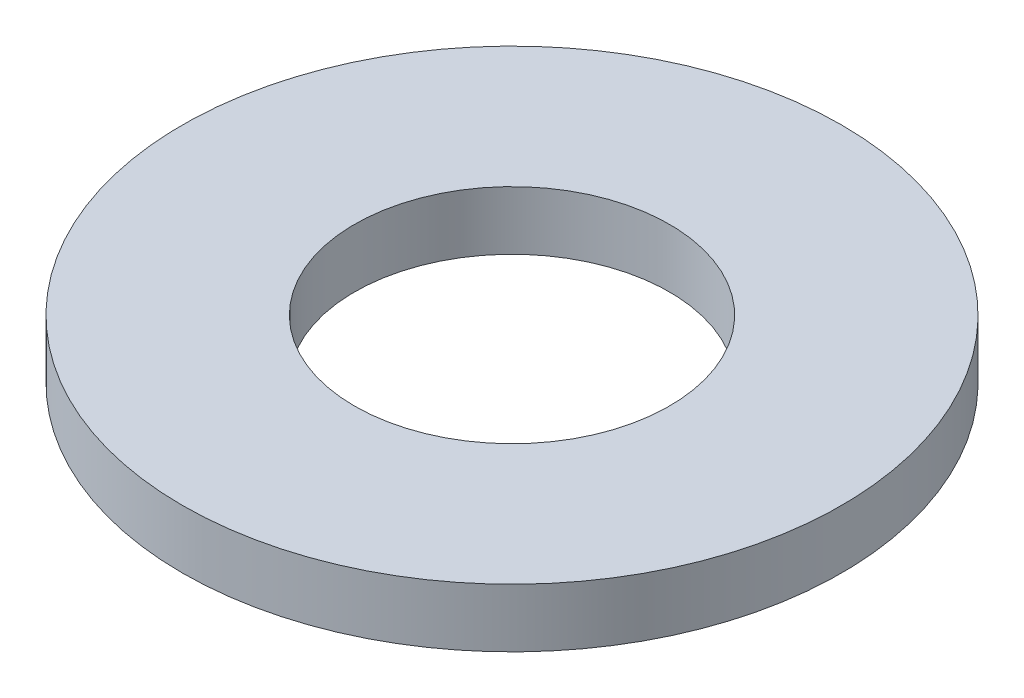
ISO-10303-21;
HEADER;
FILE_DESCRIPTION(('STEP AP214'),'2;1');
FILE_NAME('part.step','',(''),(''),'','','');
FILE_SCHEMA(('AUTOMOTIVE_DESIGN { 1 0 10303 214 1 1 1 1 }'));
ENDSEC;
DATA;
#1=APPLICATION_CONTEXT('core data for automotive mechanical design processes');
#2=APPLICATION_PROTOCOL_DEFINITION('international standard','automotive_design',2000,#1);
#3=PRODUCT_CONTEXT('',#1,'mechanical');
#4=PRODUCT('Part','Part','',(#3));
#5=PRODUCT_RELATED_PRODUCT_CATEGORY('part','',(#4));
#6=PRODUCT_DEFINITION_FORMATION('','',#4);
#7=PRODUCT_DEFINITION_CONTEXT('part definition',#1,'design');
#8=PRODUCT_DEFINITION('design','',#6,#7);
#9=PRODUCT_DEFINITION_SHAPE('','',#8);
#10=(LENGTH_UNIT() NAMED_UNIT(*) SI_UNIT(.MILLI.,.METRE.));
#11=(NAMED_UNIT(*) PLANE_ANGLE_UNIT() SI_UNIT($,.RADIAN.));
#12=(NAMED_UNIT(*) SI_UNIT($,.STERADIAN.) SOLID_ANGLE_UNIT());
#13=UNCERTAINTY_MEASURE_WITH_UNIT(LENGTH_MEASURE(1.E-05),#10,'distance_accuracy_value','');
#14=(GEOMETRIC_REPRESENTATION_CONTEXT(3) GLOBAL_UNCERTAINTY_ASSIGNED_CONTEXT((#13)) GLOBAL_UNIT_ASSIGNED_CONTEXT((#10,
#11,#12)) REPRESENTATION_CONTEXT('',''));
#15=CARTESIAN_POINT('',(0.,0.,0.));
#16=DIRECTION('',(0.,0.,1.));
#17=DIRECTION('',(1.,0.,0.));
#18=AXIS2_PLACEMENT_3D('',#15,#16,#17);
#19=CARTESIAN_POINT('',(0.,0.8,0.));
#20=DIRECTION('',(0.,1.,0.));
#21=DIRECTION('',(0.,0.,1.));
#22=AXIS2_PLACEMENT_3D('',#19,#20,#21);
#23=PLANE('',#22);
#24=CARTESIAN_POINT('',(0.,0.8,0.));
#25=DIRECTION('',(0.,1.,0.));
#26=DIRECTION('',(0.,0.,1.));
#27=AXIS2_PLACEMENT_3D('',#24,#25,#26);
#28=CIRCLE('',#27,4.5);
#29=CARTESIAN_POINT('',(0.,0.8,4.5));
#30=VERTEX_POINT('',#29);
#31=EDGE_CURVE('E10',#30,#30,#28,.T.);
#32=ORIENTED_EDGE('',*,*,#31,.T.);
#33=EDGE_LOOP('',(#32));
#34=FACE_BOUND('',#33,.T.);
#35=CARTESIAN_POINT('',(0.,0.8,0.));
#36=DIRECTION('',(0.,1.,0.));
#37=DIRECTION('',(0.,0.,1.));
#38=AXIS2_PLACEMENT_3D('',#35,#36,#37);
#39=CIRCLE('',#38,2.15);
#40=CARTESIAN_POINT('',(0.,0.8,2.15));
#41=VERTEX_POINT('',#40);
#42=EDGE_CURVE('E39',#41,#41,#39,.T.);
#43=ORIENTED_EDGE('',*,*,#42,.F.);
#44=EDGE_LOOP('',(#43));
#45=FACE_BOUND('',#44,.T.);
#46=ADVANCED_FACE('F28',(#34,#45),#23,.T.);
#47=CARTESIAN_POINT('',(0.,0.,0.));
#48=DIRECTION('',(0.,1.,0.));
#49=DIRECTION('',(0.,0.,1.));
#50=AXIS2_PLACEMENT_3D('',#47,#48,#49);
#51=PLANE('',#50);
#52=CARTESIAN_POINT('',(0.,0.,0.));
#53=DIRECTION('',(0.,1.,0.));
#54=DIRECTION('',(0.,0.,1.));
#55=AXIS2_PLACEMENT_3D('',#52,#53,#54);
#56=CIRCLE('',#55,4.5);
#57=CARTESIAN_POINT('',(0.,0.,4.5));
#58=VERTEX_POINT('',#57);
#59=EDGE_CURVE('E32',#58,#58,#56,.T.);
#60=ORIENTED_EDGE('',*,*,#59,.F.);
#61=EDGE_LOOP('',(#60));
#62=FACE_BOUND('',#61,.T.);
#63=CARTESIAN_POINT('',(0.,0.,0.));
#64=DIRECTION('',(0.,1.,0.));
#65=DIRECTION('',(0.,0.,1.));
#66=AXIS2_PLACEMENT_3D('',#63,#64,#65);
#67=CIRCLE('',#66,2.15);
#68=CARTESIAN_POINT('',(0.,0.,2.15));
#69=VERTEX_POINT('',#68);
#70=EDGE_CURVE('E41',#69,#69,#67,.T.);
#71=ORIENTED_EDGE('',*,*,#70,.T.);
#72=EDGE_LOOP('',(#71));
#73=FACE_BOUND('',#72,.T.);
#74=ADVANCED_FACE('F51',(#62,#73),#51,.F.);
#75=CARTESIAN_POINT('',(0.,0.8,0.));
#76=DIRECTION('',(0.,-1.,0.));
#77=DIRECTION('',(0.,0.,-1.));
#78=AXIS2_PLACEMENT_3D('',#75,#76,#77);
#79=CYLINDRICAL_SURFACE('',#78,4.5);
#80=ORIENTED_EDGE('',*,*,#31,.F.);
#81=EDGE_LOOP('',(#80));
#82=FACE_BOUND('',#81,.T.);
#83=ORIENTED_EDGE('',*,*,#59,.T.);
#84=EDGE_LOOP('',(#83));
#85=FACE_BOUND('',#84,.T.);
#86=ADVANCED_FACE('F30',(#82,#85),#79,.T.);
#87=CARTESIAN_POINT('',(0.,0.8,0.));
#88=DIRECTION('',(0.,-1.,0.));
#89=DIRECTION('',(0.,0.,-1.));
#90=AXIS2_PLACEMENT_3D('',#87,#88,#89);
#91=CYLINDRICAL_SURFACE('',#90,2.15);
#92=ORIENTED_EDGE('',*,*,#42,.T.);
#93=EDGE_LOOP('',(#92));
#94=FACE_BOUND('',#93,.T.);
#95=ORIENTED_EDGE('',*,*,#70,.F.);
#96=EDGE_LOOP('',(#95));
#97=FACE_BOUND('',#96,.T.);
#98=ADVANCED_FACE('F47',(#94,#97),#91,.F.);
#99=CLOSED_SHELL('',(#46,#74,#86,#98));
#100=MANIFOLD_SOLID_BREP('B2',#99);
#101=ADVANCED_BREP_SHAPE_REPRESENTATION('',(#18,#100),#14);
#102=SHAPE_DEFINITION_REPRESENTATION(#9,#101);
ENDSEC;
END-ISO-10303-21;
